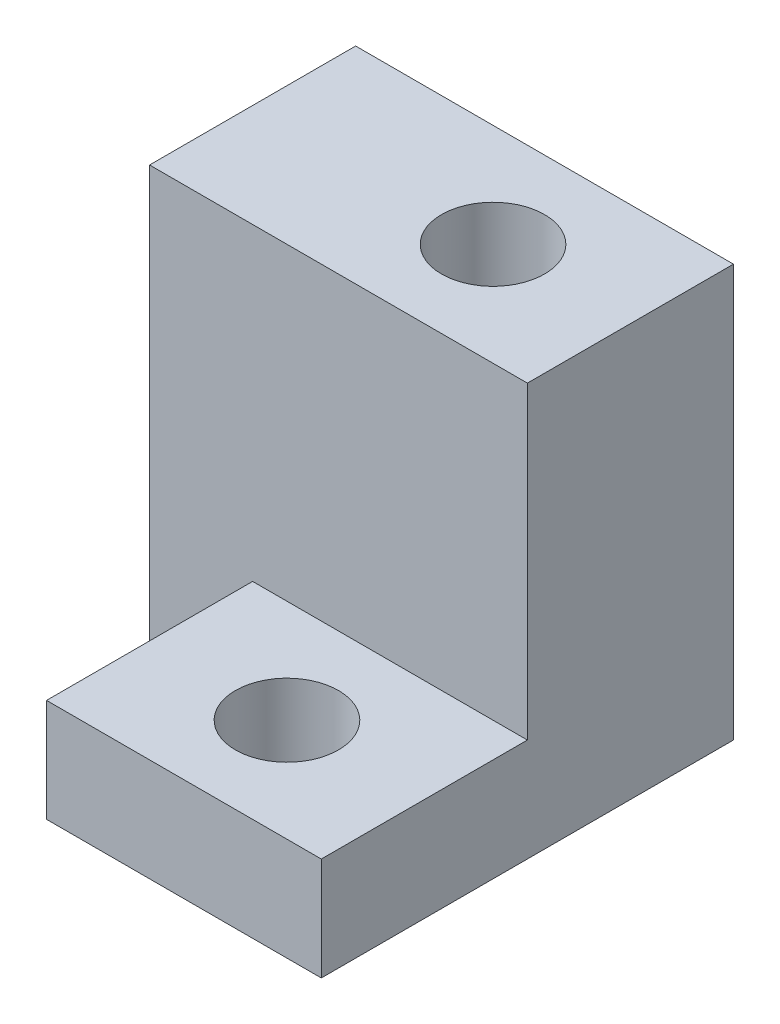
ISO-10303-21;
HEADER;
FILE_DESCRIPTION(('STEP AP214'),'2;1');
FILE_NAME('part.step','',(''),(''),'','','');
FILE_SCHEMA(('AUTOMOTIVE_DESIGN { 1 0 10303 214 1 1 1 1 }'));
ENDSEC;
DATA;
#1=APPLICATION_CONTEXT('core data for automotive mechanical design processes');
#2=APPLICATION_PROTOCOL_DEFINITION('international standard','automotive_design',2000,#1);
#3=PRODUCT_CONTEXT('',#1,'mechanical');
#4=PRODUCT('Part','Part','',(#3));
#5=PRODUCT_RELATED_PRODUCT_CATEGORY('part','',(#4));
#6=PRODUCT_DEFINITION_FORMATION('','',#4);
#7=PRODUCT_DEFINITION_CONTEXT('part definition',#1,'design');
#8=PRODUCT_DEFINITION('design','',#6,#7);
#9=PRODUCT_DEFINITION_SHAPE('','',#8);
#10=(LENGTH_UNIT() NAMED_UNIT(*) SI_UNIT(.MILLI.,.METRE.));
#11=(NAMED_UNIT(*) PLANE_ANGLE_UNIT() SI_UNIT($,.RADIAN.));
#12=(NAMED_UNIT(*) SI_UNIT($,.STERADIAN.) SOLID_ANGLE_UNIT());
#13=UNCERTAINTY_MEASURE_WITH_UNIT(LENGTH_MEASURE(1.E-05),#10,'distance_accuracy_value','');
#14=(GEOMETRIC_REPRESENTATION_CONTEXT(3) GLOBAL_UNCERTAINTY_ASSIGNED_CONTEXT((#13)) GLOBAL_UNIT_ASSIGNED_CONTEXT((#10,
#11,#12)) REPRESENTATION_CONTEXT('',''));
#15=CARTESIAN_POINT('',(0.,0.,0.));
#16=DIRECTION('',(0.,0.,1.));
#17=DIRECTION('',(1.,0.,0.));
#18=AXIS2_PLACEMENT_3D('',#15,#16,#17);
#19=CARTESIAN_POINT('',(0.,0.,6.));
#20=DIRECTION('',(0.,0.,-1.));
#21=DIRECTION('',(-1.,0.,0.));
#22=AXIS2_PLACEMENT_3D('',#19,#20,#21);
#23=PLANE('',#22);
#24=DIRECTION('',(0.,-1.,0.));
#25=VECTOR('',#24,1.);
#26=CARTESIAN_POINT('',(3.,0.,6.));
#27=LINE('',#26,#25);
#28=CARTESIAN_POINT('',(3.,3.,6.));
#29=VERTEX_POINT('',#28);
#30=CARTESIAN_POINT('',(3.,0.,6.));
#31=VERTEX_POINT('',#30);
#32=EDGE_CURVE('E119',#29,#31,#27,.T.);
#33=ORIENTED_EDGE('',*,*,#32,.F.);
#34=DIRECTION('',(-1.,0.,0.));
#35=VECTOR('',#34,1.);
#36=CARTESIAN_POINT('',(11.,3.,6.));
#37=LINE('',#36,#35);
#38=CARTESIAN_POINT('',(11.,3.,6.));
#39=VERTEX_POINT('',#38);
#40=EDGE_CURVE('E55',#39,#29,#37,.T.);
#41=ORIENTED_EDGE('',*,*,#40,.F.);
#42=DIRECTION('',(0.,1.,0.));
#43=VECTOR('',#42,1.);
#44=CARTESIAN_POINT('',(11.,0.,6.));
#45=LINE('',#44,#43);
#46=CARTESIAN_POINT('',(11.,12.,6.));
#47=VERTEX_POINT('',#46);
#48=EDGE_CURVE('E123',#39,#47,#45,.T.);
#49=ORIENTED_EDGE('',*,*,#48,.T.);
#50=DIRECTION('',(-1.,0.,0.));
#51=VECTOR('',#50,1.);
#52=CARTESIAN_POINT('',(0.,12.,6.));
#53=LINE('',#52,#51);
#54=CARTESIAN_POINT('',(0.,12.,6.));
#55=VERTEX_POINT('',#54);
#56=EDGE_CURVE('E144',#47,#55,#53,.T.);
#57=ORIENTED_EDGE('',*,*,#56,.T.);
#58=DIRECTION('',(0.,-1.,0.));
#59=VECTOR('',#58,1.);
#60=CARTESIAN_POINT('',(0.,0.,6.));
#61=LINE('',#60,#59);
#62=CARTESIAN_POINT('',(0.,0.,6.));
#63=VERTEX_POINT('',#62);
#64=EDGE_CURVE('E136',#55,#63,#61,.T.);
#65=ORIENTED_EDGE('',*,*,#64,.T.);
#66=DIRECTION('',(1.,0.,0.));
#67=VECTOR('',#66,1.);
#68=CARTESIAN_POINT('',(0.,0.,6.));
#69=LINE('',#68,#67);
#70=EDGE_CURVE('E61',#63,#31,#69,.T.);
#71=ORIENTED_EDGE('',*,*,#70,.T.);
#72=EDGE_LOOP('',(#33,#41,#49,#57,#65,#71));
#73=FACE_BOUND('',#72,.T.);
#74=ADVANCED_FACE('F39',(#73),#23,.F.);
#75=CARTESIAN_POINT('',(0.,0.,6.));
#76=DIRECTION('',(1.,0.,0.));
#77=DIRECTION('',(0.,0.,-1.));
#78=AXIS2_PLACEMENT_3D('',#75,#76,#77);
#79=PLANE('',#78);
#80=DIRECTION('',(0.,-1.,0.));
#81=VECTOR('',#80,1.);
#82=CARTESIAN_POINT('',(0.,0.,0.));
#83=LINE('',#82,#81);
#84=CARTESIAN_POINT('',(0.,12.,0.));
#85=VERTEX_POINT('',#84);
#86=CARTESIAN_POINT('',(0.,0.,0.));
#87=VERTEX_POINT('',#86);
#88=EDGE_CURVE('E125',#85,#87,#83,.T.);
#89=ORIENTED_EDGE('',*,*,#88,.T.);
#90=DIRECTION('',(0.,0.,-1.));
#91=VECTOR('',#90,1.);
#92=CARTESIAN_POINT('',(0.,0.,6.));
#93=LINE('',#92,#91);
#94=EDGE_CURVE('E11',#63,#87,#93,.T.);
#95=ORIENTED_EDGE('',*,*,#94,.F.);
#96=ORIENTED_EDGE('',*,*,#64,.F.);
#97=DIRECTION('',(0.,0.,-1.));
#98=VECTOR('',#97,1.);
#99=CARTESIAN_POINT('',(0.,12.,6.));
#100=LINE('',#99,#98);
#101=EDGE_CURVE('E146',#55,#85,#100,.T.);
#102=ORIENTED_EDGE('',*,*,#101,.T.);
#103=EDGE_LOOP('',(#89,#95,#96,#102));
#104=FACE_BOUND('',#103,.T.);
#105=ADVANCED_FACE('F41',(#104),#79,.F.);
#106=CARTESIAN_POINT('',(0.,0.,6.));
#107=DIRECTION('',(0.,1.,0.));
#108=DIRECTION('',(0.,0.,1.));
#109=AXIS2_PLACEMENT_3D('',#106,#107,#108);
#110=PLANE('',#109);
#111=CARTESIAN_POINT('',(7.,0.,3.));
#112=DIRECTION('',(0.,1.,0.));
#113=DIRECTION('',(0.,0.,1.));
#114=AXIS2_PLACEMENT_3D('',#111,#112,#113);
#115=CIRCLE('',#114,1.5);
#116=CARTESIAN_POINT('',(7.,0.,4.5));
#117=VERTEX_POINT('',#116);
#118=EDGE_CURVE('E197',#117,#117,#115,.T.);
#119=ORIENTED_EDGE('',*,*,#118,.T.);
#120=EDGE_LOOP('',(#119));
#121=FACE_BOUND('',#120,.T.);
#122=CARTESIAN_POINT('',(7.,0.,9.));
#123=DIRECTION('',(0.,1.,0.));
#124=DIRECTION('',(0.,0.,1.));
#125=AXIS2_PLACEMENT_3D('',#122,#123,#124);
#126=CIRCLE('',#125,1.5);
#127=CARTESIAN_POINT('',(7.,0.,10.5));
#128=VERTEX_POINT('',#127);
#129=EDGE_CURVE('E200',#128,#128,#126,.T.);
#130=ORIENTED_EDGE('',*,*,#129,.T.);
#131=EDGE_LOOP('',(#130));
#132=FACE_BOUND('',#131,.T.);
#133=DIRECTION('',(1.,0.,0.));
#134=VECTOR('',#133,1.);
#135=CARTESIAN_POINT('',(0.,0.,0.));
#136=LINE('',#135,#134);
#137=CARTESIAN_POINT('',(11.,0.,0.));
#138=VERTEX_POINT('',#137);
#139=EDGE_CURVE('E130',#87,#138,#136,.T.);
#140=ORIENTED_EDGE('',*,*,#139,.T.);
#141=DIRECTION('',(0.,0.,-1.));
#142=VECTOR('',#141,1.);
#143=CARTESIAN_POINT('',(11.,0.,6.));
#144=LINE('',#143,#142);
#145=CARTESIAN_POINT('',(11.,0.,12.));
#146=VERTEX_POINT('',#145);
#147=EDGE_CURVE('E48',#146,#138,#144,.T.);
#148=ORIENTED_EDGE('',*,*,#147,.F.);
#149=DIRECTION('',(1.,0.,0.));
#150=VECTOR('',#149,1.);
#151=CARTESIAN_POINT('',(11.,0.,12.));
#152=LINE('',#151,#150);
#153=CARTESIAN_POINT('',(3.,0.,12.));
#154=VERTEX_POINT('',#153);
#155=EDGE_CURVE('E115',#154,#146,#152,.T.);
#156=ORIENTED_EDGE('',*,*,#155,.F.);
#157=DIRECTION('',(0.,0.,-1.));
#158=VECTOR('',#157,1.);
#159=CARTESIAN_POINT('',(3.,0.,12.));
#160=LINE('',#159,#158);
#161=EDGE_CURVE('E132',#154,#31,#160,.T.);
#162=ORIENTED_EDGE('',*,*,#161,.T.);
#163=ORIENTED_EDGE('',*,*,#70,.F.);
#164=ORIENTED_EDGE('',*,*,#94,.T.);
#165=EDGE_LOOP('',(#140,#148,#156,#162,#163,#164));
#166=FACE_BOUND('',#165,.T.);
#167=ADVANCED_FACE('F180',(#121,#132,#166),#110,.F.);
#168=CARTESIAN_POINT('',(11.,0.,6.));
#169=DIRECTION('',(-1.,0.,0.));
#170=DIRECTION('',(0.,0.,1.));
#171=AXIS2_PLACEMENT_3D('',#168,#169,#170);
#172=PLANE('',#171);
#173=DIRECTION('',(0.,1.,0.));
#174=VECTOR('',#173,1.);
#175=CARTESIAN_POINT('',(11.,0.,0.));
#176=LINE('',#175,#174);
#177=CARTESIAN_POINT('',(11.,12.,0.));
#178=VERTEX_POINT('',#177);
#179=EDGE_CURVE('E150',#138,#178,#176,.T.);
#180=ORIENTED_EDGE('',*,*,#179,.T.);
#181=DIRECTION('',(0.,0.,-1.));
#182=VECTOR('',#181,1.);
#183=CARTESIAN_POINT('',(11.,12.,6.));
#184=LINE('',#183,#182);
#185=EDGE_CURVE('E158',#47,#178,#184,.T.);
#186=ORIENTED_EDGE('',*,*,#185,.F.);
#187=ORIENTED_EDGE('',*,*,#48,.F.);
#188=DIRECTION('',(0.,0.,-1.));
#189=VECTOR('',#188,1.);
#190=CARTESIAN_POINT('',(11.,3.,12.));
#191=LINE('',#190,#189);
#192=CARTESIAN_POINT('',(11.,3.,12.));
#193=VERTEX_POINT('',#192);
#194=EDGE_CURVE('E102',#193,#39,#191,.T.);
#195=ORIENTED_EDGE('',*,*,#194,.F.);
#196=DIRECTION('',(0.,1.,0.));
#197=VECTOR('',#196,1.);
#198=CARTESIAN_POINT('',(11.,0.,12.));
#199=LINE('',#198,#197);
#200=EDGE_CURVE('E109',#146,#193,#199,.T.);
#201=ORIENTED_EDGE('',*,*,#200,.F.);
#202=ORIENTED_EDGE('',*,*,#147,.T.);
#203=EDGE_LOOP('',(#180,#186,#187,#195,#201,#202));
#204=FACE_BOUND('',#203,.T.);
#205=ADVANCED_FACE('F121',(#204),#172,.F.);
#206=CARTESIAN_POINT('',(0.,12.,6.));
#207=DIRECTION('',(0.,-1.,0.));
#208=DIRECTION('',(0.,0.,-1.));
#209=AXIS2_PLACEMENT_3D('',#206,#207,#208);
#210=PLANE('',#209);
#211=CARTESIAN_POINT('',(7.,12.,3.));
#212=DIRECTION('',(0.,1.,0.));
#213=DIRECTION('',(0.,0.,1.));
#214=AXIS2_PLACEMENT_3D('',#211,#212,#213);
#215=CIRCLE('',#214,1.5);
#216=CARTESIAN_POINT('',(7.,12.,4.5));
#217=VERTEX_POINT('',#216);
#218=EDGE_CURVE('E222',#217,#217,#215,.T.);
#219=ORIENTED_EDGE('',*,*,#218,.F.);
#220=EDGE_LOOP('',(#219));
#221=FACE_BOUND('',#220,.T.);
#222=DIRECTION('',(-1.,0.,0.));
#223=VECTOR('',#222,1.);
#224=CARTESIAN_POINT('',(0.,12.,0.));
#225=LINE('',#224,#223);
#226=EDGE_CURVE('E139',#178,#85,#225,.T.);
#227=ORIENTED_EDGE('',*,*,#226,.T.);
#228=ORIENTED_EDGE('',*,*,#101,.F.);
#229=ORIENTED_EDGE('',*,*,#56,.F.);
#230=ORIENTED_EDGE('',*,*,#185,.T.);
#231=EDGE_LOOP('',(#227,#228,#229,#230));
#232=FACE_BOUND('',#231,.T.);
#233=ADVANCED_FACE('F170',(#221,#232),#210,.F.);
#234=CARTESIAN_POINT('',(0.,0.,0.));
#235=DIRECTION('',(0.,0.,-1.));
#236=DIRECTION('',(-1.,0.,0.));
#237=AXIS2_PLACEMENT_3D('',#234,#235,#236);
#238=PLANE('',#237);
#239=ORIENTED_EDGE('',*,*,#88,.F.);
#240=ORIENTED_EDGE('',*,*,#226,.F.);
#241=ORIENTED_EDGE('',*,*,#179,.F.);
#242=ORIENTED_EDGE('',*,*,#139,.F.);
#243=EDGE_LOOP('',(#239,#240,#241,#242));
#244=FACE_BOUND('',#243,.T.);
#245=ADVANCED_FACE('F167',(#244),#238,.T.);
#246=CARTESIAN_POINT('',(11.,3.,12.));
#247=DIRECTION('',(0.,-1.,0.));
#248=DIRECTION('',(1.,0.,0.));
#249=AXIS2_PLACEMENT_3D('',#246,#247,#248);
#250=PLANE('',#249);
#251=CARTESIAN_POINT('',(7.,3.,9.));
#252=DIRECTION('',(0.,1.,0.));
#253=DIRECTION('',(-1.,0.,0.));
#254=AXIS2_PLACEMENT_3D('',#251,#252,#253);
#255=CIRCLE('',#254,1.5);
#256=CARTESIAN_POINT('',(5.5,3.,9.));
#257=VERTEX_POINT('',#256);
#258=EDGE_CURVE('E216',#257,#257,#255,.T.);
#259=ORIENTED_EDGE('',*,*,#258,.F.);
#260=EDGE_LOOP('',(#259));
#261=FACE_BOUND('',#260,.T.);
#262=ORIENTED_EDGE('',*,*,#40,.T.);
#263=DIRECTION('',(0.,0.,-1.));
#264=VECTOR('',#263,1.);
#265=CARTESIAN_POINT('',(3.,3.,12.));
#266=LINE('',#265,#264);
#267=CARTESIAN_POINT('',(3.,3.,12.));
#268=VERTEX_POINT('',#267);
#269=EDGE_CURVE('E104',#268,#29,#266,.T.);
#270=ORIENTED_EDGE('',*,*,#269,.F.);
#271=DIRECTION('',(-1.,0.,0.));
#272=VECTOR('',#271,1.);
#273=CARTESIAN_POINT('',(11.,3.,12.));
#274=LINE('',#273,#272);
#275=EDGE_CURVE('E98',#193,#268,#274,.T.);
#276=ORIENTED_EDGE('',*,*,#275,.F.);
#277=ORIENTED_EDGE('',*,*,#194,.T.);
#278=EDGE_LOOP('',(#262,#270,#276,#277));
#279=FACE_BOUND('',#278,.T.);
#280=ADVANCED_FACE('F100',(#261,#279),#250,.F.);
#281=CARTESIAN_POINT('',(3.,0.,12.));
#282=DIRECTION('',(1.,0.,0.));
#283=DIRECTION('',(0.,0.,-1.));
#284=AXIS2_PLACEMENT_3D('',#281,#282,#283);
#285=PLANE('',#284);
#286=ORIENTED_EDGE('',*,*,#32,.T.);
#287=ORIENTED_EDGE('',*,*,#161,.F.);
#288=DIRECTION('',(0.,-1.,0.));
#289=VECTOR('',#288,1.);
#290=CARTESIAN_POINT('',(3.,0.,12.));
#291=LINE('',#290,#289);
#292=EDGE_CURVE('E108',#268,#154,#291,.T.);
#293=ORIENTED_EDGE('',*,*,#292,.F.);
#294=ORIENTED_EDGE('',*,*,#269,.T.);
#295=EDGE_LOOP('',(#286,#287,#293,#294));
#296=FACE_BOUND('',#295,.T.);
#297=ADVANCED_FACE('F239',(#296),#285,.F.);
#298=CARTESIAN_POINT('',(0.,0.,12.));
#299=DIRECTION('',(0.,0.,1.));
#300=DIRECTION('',(1.,0.,0.));
#301=AXIS2_PLACEMENT_3D('',#298,#299,#300);
#302=PLANE('',#301);
#303=ORIENTED_EDGE('',*,*,#200,.T.);
#304=ORIENTED_EDGE('',*,*,#275,.T.);
#305=ORIENTED_EDGE('',*,*,#292,.T.);
#306=ORIENTED_EDGE('',*,*,#155,.T.);
#307=EDGE_LOOP('',(#303,#304,#305,#306));
#308=FACE_BOUND('',#307,.T.);
#309=ADVANCED_FACE('F113',(#308),#302,.T.);
#310=CARTESIAN_POINT('',(7.,-3.,9.));
#311=DIRECTION('',(0.,1.,0.));
#312=DIRECTION('',(-1.,0.,0.));
#313=AXIS2_PLACEMENT_3D('',#310,#311,#312);
#314=CYLINDRICAL_SURFACE('',#313,1.5);
#315=ORIENTED_EDGE('',*,*,#258,.T.);
#316=EDGE_LOOP('',(#315));
#317=FACE_BOUND('',#316,.T.);
#318=ORIENTED_EDGE('',*,*,#129,.F.);
#319=EDGE_LOOP('',(#318));
#320=FACE_BOUND('',#319,.T.);
#321=ADVANCED_FACE('F230',(#317,#320),#314,.F.);
#322=CARTESIAN_POINT('',(7.,-4.00000000000001,3.));
#323=DIRECTION('',(0.,1.,0.));
#324=DIRECTION('',(0.,0.,1.));
#325=AXIS2_PLACEMENT_3D('',#322,#323,#324);
#326=CYLINDRICAL_SURFACE('',#325,1.5);
#327=ORIENTED_EDGE('',*,*,#218,.T.);
#328=EDGE_LOOP('',(#327));
#329=FACE_BOUND('',#328,.T.);
#330=ORIENTED_EDGE('',*,*,#118,.F.);
#331=EDGE_LOOP('',(#330));
#332=FACE_BOUND('',#331,.T.);
#333=ADVANCED_FACE('F227',(#329,#332),#326,.F.);
#334=CLOSED_SHELL('',(#74,#105,#167,#205,#233,#245,#280,#297,#309,#321,#333));
#335=MANIFOLD_SOLID_BREP('B2',#334);
#336=ADVANCED_BREP_SHAPE_REPRESENTATION('',(#18,#335),#14);
#337=SHAPE_DEFINITION_REPRESENTATION(#9,#336);
ENDSEC;
END-ISO-10303-21;
